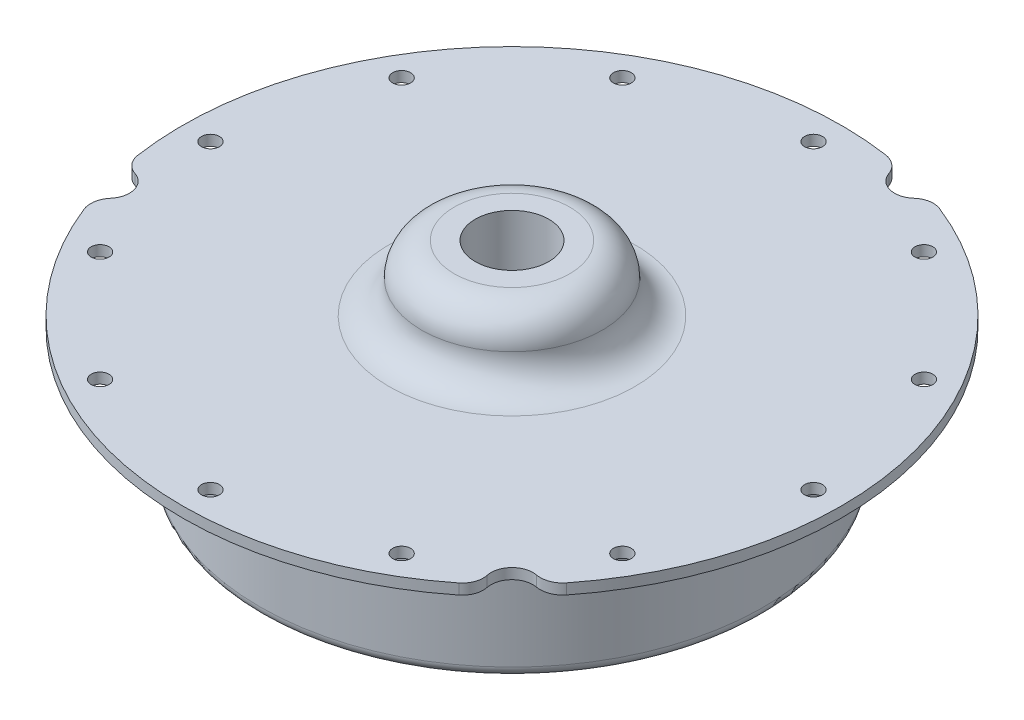
ISO-10303-21;
HEADER;
FILE_DESCRIPTION(('STEP AP214'),'2;1');
FILE_NAME('part.step','',(''),(''),'','','');
FILE_SCHEMA(('AUTOMOTIVE_DESIGN { 1 0 10303 214 1 1 1 1 }'));
ENDSEC;
DATA;
#1=APPLICATION_CONTEXT('core data for automotive mechanical design processes');
#2=APPLICATION_PROTOCOL_DEFINITION('international standard','automotive_design',2000,#1);
#3=PRODUCT_CONTEXT('',#1,'mechanical');
#4=PRODUCT('Part','Part','',(#3));
#5=PRODUCT_RELATED_PRODUCT_CATEGORY('part','',(#4));
#6=PRODUCT_DEFINITION_FORMATION('','',#4);
#7=PRODUCT_DEFINITION_CONTEXT('part definition',#1,'design');
#8=PRODUCT_DEFINITION('design','',#6,#7);
#9=PRODUCT_DEFINITION_SHAPE('','',#8);
#10=(LENGTH_UNIT() NAMED_UNIT(*) SI_UNIT(.MILLI.,.METRE.));
#11=(NAMED_UNIT(*) PLANE_ANGLE_UNIT() SI_UNIT($,.RADIAN.));
#12=(NAMED_UNIT(*) SI_UNIT($,.STERADIAN.) SOLID_ANGLE_UNIT());
#13=UNCERTAINTY_MEASURE_WITH_UNIT(LENGTH_MEASURE(1.E-05),#10,'distance_accuracy_value','');
#14=(GEOMETRIC_REPRESENTATION_CONTEXT(3) GLOBAL_UNCERTAINTY_ASSIGNED_CONTEXT((#13)) GLOBAL_UNIT_ASSIGNED_CONTEXT((#10,
#11,#12)) REPRESENTATION_CONTEXT('',''));
#15=CARTESIAN_POINT('',(0.,0.,0.));
#16=DIRECTION('',(0.,0.,1.));
#17=DIRECTION('',(1.,0.,0.));
#18=AXIS2_PLACEMENT_3D('',#15,#16,#17);
#19=CARTESIAN_POINT('',(0.,55.,0.));
#20=DIRECTION('',(0.,1.,0.));
#21=DIRECTION('',(0.,0.,1.));
#22=AXIS2_PLACEMENT_3D('',#19,#20,#21);
#23=CYLINDRICAL_SURFACE('',#22,49.784);
#24=CARTESIAN_POINT('',(0.,0.,0.));
#25=DIRECTION('',(0.,1.,0.));
#26=DIRECTION('',(0.,0.,1.));
#27=AXIS2_PLACEMENT_3D('',#24,#25,#26);
#28=CIRCLE('',#27,49.784);
#29=CARTESIAN_POINT('',(-46.24721953603,0.,18.4293608458418));
#30=VERTEX_POINT('',#29);
#31=CARTESIAN_POINT('',(30.9609288495699,0.,38.9854785884677));
#32=VERTEX_POINT('',#31);
#33=EDGE_CURVE('E11',#30,#32,#28,.T.);
#34=ORIENTED_EDGE('',*,*,#33,.T.);
#35=DIRECTION('',(0.,1.,0.));
#36=VECTOR('',#35,1.);
#37=CARTESIAN_POINT('',(30.9609288495699,-11.9404867485435,38.9854785884677));
#38=LINE('',#37,#36);
#39=CARTESIAN_POINT('',(30.9609288495699,1.5875,38.9854785884677));
#40=VERTEX_POINT('',#39);
#41=EDGE_CURVE('E123',#32,#40,#38,.T.);
#42=ORIENTED_EDGE('',*,*,#41,.T.);
#43=CARTESIAN_POINT('',(0.,1.5875,0.));
#44=DIRECTION('',(0.,1.,0.));
#45=DIRECTION('',(0.,0.,1.));
#46=AXIS2_PLACEMENT_3D('',#43,#44,#45);
#47=CIRCLE('',#46,49.784);
#48=CARTESIAN_POINT('',(-46.24721953603,1.5875,18.4293608458418));
#49=VERTEX_POINT('',#48);
#50=EDGE_CURVE('E145',#49,#40,#47,.T.);
#51=ORIENTED_EDGE('',*,*,#50,.F.);
#52=DIRECTION('',(0.,1.,0.));
#53=VECTOR('',#52,1.);
#54=CARTESIAN_POINT('',(-46.24721953603,-11.9404867485435,18.4293608458418));
#55=LINE('',#54,#53);
#56=EDGE_CURVE('E144',#30,#49,#55,.T.);
#57=ORIENTED_EDGE('',*,*,#56,.F.);
#58=EDGE_LOOP('',(#34,#42,#51,#57));
#59=FACE_BOUND('',#58,.T.);
#60=ADVANCED_FACE('F32',(#59),#23,.T.);
#61=DIRECTION('',(0.,1.,0.));
#62=VECTOR('',#61,1.);
#63=CARTESIAN_POINT('',(39.083904436024,-11.9404867485435,30.8365865496774));
#64=LINE('',#63,#62);
#65=CARTESIAN_POINT('',(39.083904436024,0.,30.8365865496774));
#66=VERTEX_POINT('',#65);
#67=CARTESIAN_POINT('',(39.083904436024,1.5875,30.8365865496774));
#68=VERTEX_POINT('',#67);
#69=EDGE_CURVE('E284',#66,#68,#64,.T.);
#70=ORIENTED_EDGE('',*,*,#69,.F.);
#71=CARTESIAN_POINT('',(18.2819504115221,0.,-46.305690202724));
#72=VERTEX_POINT('',#71);
#73=EDGE_CURVE('E40',#66,#72,#28,.T.);
#74=ORIENTED_EDGE('',*,*,#73,.T.);
#75=DIRECTION('',(0.,1.,0.));
#76=VECTOR('',#75,1.);
#77=CARTESIAN_POINT('',(18.2819504115221,-11.9404867485435,-46.305690202724));
#78=LINE('',#77,#76);
#79=CARTESIAN_POINT('',(18.2819504115221,1.5875,-46.305690202724));
#80=VERTEX_POINT('',#79);
#81=EDGE_CURVE('E282',#72,#80,#78,.T.);
#82=ORIENTED_EDGE('',*,*,#81,.T.);
#83=EDGE_CURVE('E240',#68,#80,#47,.T.);
#84=ORIENTED_EDGE('',*,*,#83,.F.);
#85=EDGE_LOOP('',(#70,#74,#82,#84));
#86=FACE_BOUND('',#85,.T.);
#87=ADVANCED_FACE('F280',(#86),#23,.T.);
#88=CARTESIAN_POINT('',(-49.784,0.,0.));
#89=DIRECTION('',(0.,-1.,0.));
#90=DIRECTION('',(0.,0.,-1.));
#91=AXIS2_PLACEMENT_3D('',#88,#89,#90);
#92=PLANE('',#91);
#93=CARTESIAN_POINT('',(-39.45170066686,0.,-22.7774499999995));
#94=DIRECTION('',(0.,-1.,0.));
#95=DIRECTION('',(0.,0.,-1.));
#96=AXIS2_PLACEMENT_3D('',#93,#94,#95);
#97=CIRCLE('',#96,1.35254999999999);
#98=CARTESIAN_POINT('',(-39.45170066686,0.,-24.1299999999995));
#99=VERTEX_POINT('',#98);
#100=EDGE_CURVE('E167',#99,#99,#97,.T.);
#101=ORIENTED_EDGE('',*,*,#100,.F.);
#102=EDGE_LOOP('',(#101));
#103=FACE_BOUND('',#102,.T.);
#104=CARTESIAN_POINT('',(-22.7774500000005,0.,-39.4517006668595));
#105=DIRECTION('',(0.,-1.,0.));
#106=DIRECTION('',(0.,0.,-1.));
#107=AXIS2_PLACEMENT_3D('',#104,#105,#106);
#108=CIRCLE('',#107,1.35254999999999);
#109=CARTESIAN_POINT('',(-22.7774500000005,0.,-40.8042506668595));
#110=VERTEX_POINT('',#109);
#111=EDGE_CURVE('E174',#110,#110,#108,.T.);
#112=ORIENTED_EDGE('',*,*,#111,.F.);
#113=EDGE_LOOP('',(#112));
#114=FACE_BOUND('',#113,.T.);
#115=CARTESIAN_POINT('',(-4.88322161388666E-13,0.,-45.5549));
#116=DIRECTION('',(0.,-1.,0.));
#117=DIRECTION('',(0.,0.,-1.));
#118=AXIS2_PLACEMENT_3D('',#115,#116,#117);
#119=CIRCLE('',#118,1.35254999999999);
#120=CARTESIAN_POINT('',(-4.88322161388666E-13,0.,-46.90745));
#121=VERTEX_POINT('',#120);
#122=EDGE_CURVE('E180',#121,#121,#119,.T.);
#123=ORIENTED_EDGE('',*,*,#122,.F.);
#124=EDGE_LOOP('',(#123));
#125=FACE_BOUND('',#124,.T.);
#126=CARTESIAN_POINT('',(22.7774499999996,0.,-39.4517006668599));
#127=DIRECTION('',(0.,-1.,0.));
#128=DIRECTION('',(0.,0.,-1.));
#129=AXIS2_PLACEMENT_3D('',#126,#127,#128);
#130=CIRCLE('',#129,1.35254999999999);
#131=CARTESIAN_POINT('',(22.7774499999996,0.,-40.8042506668599));
#132=VERTEX_POINT('',#131);
#133=EDGE_CURVE('E186',#132,#132,#130,.T.);
#134=ORIENTED_EDGE('',*,*,#133,.F.);
#135=EDGE_LOOP('',(#134));
#136=FACE_BOUND('',#135,.T.);
#137=CARTESIAN_POINT('',(39.4517006668595,0.,-22.7774500000003));
#138=DIRECTION('',(0.,-1.,0.));
#139=DIRECTION('',(0.,0.,-1.));
#140=AXIS2_PLACEMENT_3D('',#137,#138,#139);
#141=CIRCLE('',#140,1.35254999999999);
#142=CARTESIAN_POINT('',(39.4517006668595,0.,-24.1300000000003));
#143=VERTEX_POINT('',#142);
#144=EDGE_CURVE('E192',#143,#143,#141,.T.);
#145=ORIENTED_EDGE('',*,*,#144,.F.);
#146=EDGE_LOOP('',(#145));
#147=FACE_BOUND('',#146,.T.);
#148=CARTESIAN_POINT('',(45.5549,0.,0.));
#149=DIRECTION('',(0.,-1.,0.));
#150=DIRECTION('',(0.,0.,-1.));
#151=AXIS2_PLACEMENT_3D('',#148,#149,#150);
#152=CIRCLE('',#151,1.35254999999999);
#153=CARTESIAN_POINT('',(45.5549,0.,-1.35255));
#154=VERTEX_POINT('',#153);
#155=EDGE_CURVE('E198',#154,#154,#152,.T.);
#156=ORIENTED_EDGE('',*,*,#155,.F.);
#157=EDGE_LOOP('',(#156));
#158=FACE_BOUND('',#157,.T.);
#159=CARTESIAN_POINT('',(39.4517006668598,0.,22.7774499999998));
#160=DIRECTION('',(0.,-1.,0.));
#161=DIRECTION('',(0.,0.,-1.));
#162=AXIS2_PLACEMENT_3D('',#159,#160,#161);
#163=CIRCLE('',#162,1.35254999999999);
#164=CARTESIAN_POINT('',(39.4517006668598,0.,21.4248999999998));
#165=VERTEX_POINT('',#164);
#166=EDGE_CURVE('E204',#165,#165,#163,.T.);
#167=ORIENTED_EDGE('',*,*,#166,.F.);
#168=EDGE_LOOP('',(#167));
#169=FACE_BOUND('',#168,.T.);
#170=CARTESIAN_POINT('',(22.7774500000002,0.,39.4517006668596));
#171=DIRECTION('',(0.,-1.,0.));
#172=DIRECTION('',(0.,0.,-1.));
#173=AXIS2_PLACEMENT_3D('',#170,#171,#172);
#174=CIRCLE('',#173,1.35254999999999);
#175=CARTESIAN_POINT('',(22.7774500000002,0.,38.0991506668596));
#176=VERTEX_POINT('',#175);
#177=EDGE_CURVE('E210',#176,#176,#174,.T.);
#178=ORIENTED_EDGE('',*,*,#177,.F.);
#179=EDGE_LOOP('',(#178));
#180=FACE_BOUND('',#179,.T.);
#181=CARTESIAN_POINT('',(1.59128541652108E-13,0.,45.5549));
#182=DIRECTION('',(0.,-1.,0.));
#183=DIRECTION('',(0.,0.,-1.));
#184=AXIS2_PLACEMENT_3D('',#181,#182,#183);
#185=CIRCLE('',#184,1.35254999999999);
#186=CARTESIAN_POINT('',(1.59128541652108E-13,0.,44.20235));
#187=VERTEX_POINT('',#186);
#188=EDGE_CURVE('E216',#187,#187,#185,.T.);
#189=ORIENTED_EDGE('',*,*,#188,.F.);
#190=EDGE_LOOP('',(#189));
#191=FACE_BOUND('',#190,.T.);
#192=CARTESIAN_POINT('',(-22.7774499999999,0.,39.4517006668598));
#193=DIRECTION('',(0.,-1.,0.));
#194=DIRECTION('',(0.,0.,-1.));
#195=AXIS2_PLACEMENT_3D('',#192,#193,#194);
#196=CIRCLE('',#195,1.35254999999999);
#197=CARTESIAN_POINT('',(-22.7774499999999,0.,38.0991506668598));
#198=VERTEX_POINT('',#197);
#199=EDGE_CURVE('E222',#198,#198,#196,.T.);
#200=ORIENTED_EDGE('',*,*,#199,.F.);
#201=EDGE_LOOP('',(#200));
#202=FACE_BOUND('',#201,.T.);
#203=CARTESIAN_POINT('',(-39.4517006668597,0.,22.7774500000001));
#204=DIRECTION('',(0.,-1.,0.));
#205=DIRECTION('',(0.,0.,-1.));
#206=AXIS2_PLACEMENT_3D('',#203,#204,#205);
#207=CIRCLE('',#206,1.35254999999999);
#208=CARTESIAN_POINT('',(-39.4517006668597,0.,21.4249000000001));
#209=VERTEX_POINT('',#208);
#210=EDGE_CURVE('E228',#209,#209,#207,.T.);
#211=ORIENTED_EDGE('',*,*,#210,.F.);
#212=EDGE_LOOP('',(#211));
#213=FACE_BOUND('',#212,.T.);
#214=CARTESIAN_POINT('',(-45.5549,0.,0.));
#215=DIRECTION('',(0.,-1.,0.));
#216=DIRECTION('',(0.,0.,-1.));
#217=AXIS2_PLACEMENT_3D('',#214,#215,#216);
#218=CIRCLE('',#217,1.35254999999999);
#219=CARTESIAN_POINT('',(-45.5549,0.,-1.35254999999998));
#220=VERTEX_POINT('',#219);
#221=EDGE_CURVE('E234',#220,#220,#218,.T.);
#222=ORIENTED_EDGE('',*,*,#221,.F.);
#223=EDGE_LOOP('',(#222));
#224=FACE_BOUND('',#223,.T.);
#225=CARTESIAN_POINT('',(0.,0.,0.));
#226=DIRECTION('',(0.,1.,0.));
#227=DIRECTION('',(0.,0.,1.));
#228=AXIS2_PLACEMENT_3D('',#225,#226,#227);
#229=CIRCLE('',#228,39.6874999999754);
#230=CARTESIAN_POINT('',(0.,0.,39.6874999999754));
#231=VERTEX_POINT('',#230);
#232=EDGE_CURVE('E269',#231,#231,#229,.T.);
#233=ORIENTED_EDGE('',*,*,#232,.T.);
#234=EDGE_LOOP('',(#233));
#235=FACE_BOUND('',#234,.T.);
#236=ORIENTED_EDGE('',*,*,#73,.F.);
#237=CARTESIAN_POINT('',(36.4006860905184,0.,28.7195694313314));
#238=DIRECTION('',(0.,-1.,0.));
#239=DIRECTION('',(0.,0.,-1.));
#240=AXIS2_PLACEMENT_3D('',#237,#238,#239);
#241=CIRCLE('',#240,3.41780955716199);
#242=CARTESIAN_POINT('',(35.7795826895749,0.,32.0804700151577));
#243=VERTEX_POINT('',#242);
#244=EDGE_CURVE('E286',#243,#66,#241,.F.);
#245=ORIENTED_EDGE('',*,*,#244,.F.);
#246=CARTESIAN_POINT('',(35.2026039945908,0.,35.2026039945914));
#247=DIRECTION('',(0.,-1.,0.));
#248=DIRECTION('',(0.,0.,-1.));
#249=AXIS2_PLACEMENT_3D('',#246,#247,#248);
#250=CIRCLE('',#249,3.17500000000001);
#251=CARTESIAN_POINT('',(32.0944919051936,0.,35.8508818977646));
#252=VERTEX_POINT('',#251);
#253=EDGE_CURVE('E140',#252,#243,#250,.T.);
#254=ORIENTED_EDGE('',*,*,#253,.F.);
#255=CARTESIAN_POINT('',(28.9863798157963,0.,36.4991598009378));
#256=DIRECTION('',(0.,-1.,0.));
#257=DIRECTION('',(0.,0.,-1.));
#258=AXIS2_PLACEMENT_3D('',#255,#256,#257);
#259=CIRCLE('',#258,3.175);
#260=EDGE_CURVE('E126',#32,#252,#259,.F.);
#261=ORIENTED_EDGE('',*,*,#260,.F.);
#262=ORIENTED_EDGE('',*,*,#33,.F.);
#263=CARTESIAN_POINT('',(-43.072219758543,0.,17.1641341539066));
#264=DIRECTION('',(0.,-1.,0.));
#265=DIRECTION('',(0.,0.,-1.));
#266=AXIS2_PLACEMENT_3D('',#263,#264,#265);
#267=CIRCLE('',#266,3.417809557162);
#268=CARTESIAN_POINT('',(-45.6722933432588,0.,14.9457925383994));
#269=VERTEX_POINT('',#268);
#270=EDGE_CURVE('E317',#269,#30,#267,.F.);
#271=ORIENTED_EDGE('',*,*,#270,.F.);
#272=CARTESIAN_POINT('',(-48.087651335975,0.,12.885047341384));
#273=DIRECTION('',(0.,-1.,0.));
#274=DIRECTION('',(0.,0.,-1.));
#275=AXIS2_PLACEMENT_3D('',#272,#273,#274);
#276=CIRCLE('',#275,3.175);
#277=CARTESIAN_POINT('',(-47.0950204241365,0.,9.8692043625698));
#278=VERTEX_POINT('',#277);
#279=EDGE_CURVE('E156',#278,#269,#276,.T.);
#280=ORIENTED_EDGE('',*,*,#279,.F.);
#281=CARTESIAN_POINT('',(-46.102389512298,0.,6.85336138375563));
#282=DIRECTION('',(0.,-1.,0.));
#283=DIRECTION('',(0.,0.,-1.));
#284=AXIS2_PLACEMENT_3D('',#281,#282,#283);
#285=CIRCLE('',#284,3.175);
#286=CARTESIAN_POINT('',(-49.2428792610922,0.,7.32021161425669));
#287=VERTEX_POINT('',#286);
#288=EDGE_CURVE('E168',#287,#278,#285,.F.);
#289=ORIENTED_EDGE('',*,*,#288,.F.);
#290=CARTESIAN_POINT('',(7.16331569483476,0.,-49.2659473090301));
#291=VERTEX_POINT('',#290);
#292=EDGE_CURVE('E41',#291,#287,#28,.T.);
#293=ORIENTED_EDGE('',*,*,#292,.F.);
#294=CARTESIAN_POINT('',(6.67153366802452,0.,-45.8837035852375));
#295=DIRECTION('',(0.,-1.,0.));
#296=DIRECTION('',(0.,0.,-1.));
#297=AXIS2_PLACEMENT_3D('',#294,#295,#296);
#298=CIRCLE('',#297,3.417809557162);
#299=CARTESIAN_POINT('',(9.8927106536838,0.,-47.0262625535567));
#300=VERTEX_POINT('',#299);
#301=EDGE_CURVE('E297',#300,#291,#298,.F.);
#302=ORIENTED_EDGE('',*,*,#301,.F.);
#303=CARTESIAN_POINT('',(12.885047341384,0.,-48.087651335975));
#304=DIRECTION('',(0.,-1.,0.));
#305=DIRECTION('',(0.,0.,-1.));
#306=AXIS2_PLACEMENT_3D('',#303,#304,#305);
#307=CIRCLE('',#306,3.17500000000001);
#308=CARTESIAN_POINT('',(15.0005285189428,0.,-45.720086260334));
#309=VERTEX_POINT('',#308);
#310=EDGE_CURVE('E292',#309,#300,#307,.T.);
#311=ORIENTED_EDGE('',*,*,#310,.F.);
#312=CARTESIAN_POINT('',(17.1160096965016,0.,-43.3525211846931));
#313=DIRECTION('',(0.,-1.,0.));
#314=DIRECTION('',(0.,0.,-1.));
#315=AXIS2_PLACEMENT_3D('',#312,#313,#314);
#316=CIRCLE('',#315,3.175);
#317=EDGE_CURVE('E289',#72,#309,#316,.F.);
#318=ORIENTED_EDGE('',*,*,#317,.F.);
#319=EDGE_LOOP('',(#236,#245,#254,#261,#262,#271,#280,#289,#293,#302,#311,#318));
#320=FACE_BOUND('',#319,.T.);
#321=ADVANCED_FACE('F137',(#103,#114,#125,#136,#147,#158,#169,#180,#191,#202,#213,#224,#235,
#320),#92,.T.);
#322=CARTESIAN_POINT('',(-49.784,1.5875,0.));
#323=DIRECTION('',(0.,1.,0.));
#324=DIRECTION('',(0.,0.,1.));
#325=AXIS2_PLACEMENT_3D('',#322,#323,#324);
#326=PLANE('',#325);
#327=CARTESIAN_POINT('',(-39.45170066686,1.58750000000002,-22.7774499999995));
#328=DIRECTION('',(0.,1.,0.));
#329=DIRECTION('',(0.,0.,1.));
#330=AXIS2_PLACEMENT_3D('',#327,#328,#329);
#331=CIRCLE('',#330,1.35254999999999);
#332=CARTESIAN_POINT('',(-39.45170066686,1.58750000000002,-21.4248999999995));
#333=VERTEX_POINT('',#332);
#334=EDGE_CURVE('E164',#333,#333,#331,.T.);
#335=ORIENTED_EDGE('',*,*,#334,.F.);
#336=EDGE_LOOP('',(#335));
#337=FACE_BOUND('',#336,.T.);
#338=CARTESIAN_POINT('',(-22.7774500000005,1.58750000000008,-39.4517006668595));
#339=DIRECTION('',(0.,1.,0.));
#340=DIRECTION('',(0.,0.,1.));
#341=AXIS2_PLACEMENT_3D('',#338,#339,#340);
#342=CIRCLE('',#341,1.35254999999999);
#343=CARTESIAN_POINT('',(-22.7774500000005,1.58750000000008,-38.0991506668595));
#344=VERTEX_POINT('',#343);
#345=EDGE_CURVE('E171',#344,#344,#342,.T.);
#346=ORIENTED_EDGE('',*,*,#345,.F.);
#347=EDGE_LOOP('',(#346));
#348=FACE_BOUND('',#347,.T.);
#349=CARTESIAN_POINT('',(-4.88322161388666E-13,1.58750000000016,-45.5549));
#350=DIRECTION('',(0.,1.,0.));
#351=DIRECTION('',(0.,0.,1.));
#352=AXIS2_PLACEMENT_3D('',#349,#350,#351);
#353=CIRCLE('',#352,1.35254999999999);
#354=CARTESIAN_POINT('',(-4.88322161388666E-13,1.58750000000016,-44.20235));
#355=VERTEX_POINT('',#354);
#356=EDGE_CURVE('E177',#355,#355,#353,.T.);
#357=ORIENTED_EDGE('',*,*,#356,.F.);
#358=EDGE_LOOP('',(#357));
#359=FACE_BOUND('',#358,.T.);
#360=CARTESIAN_POINT('',(22.7774499999996,1.58750000000024,-39.4517006668599));
#361=DIRECTION('',(0.,1.,0.));
#362=DIRECTION('',(0.,0.,1.));
#363=AXIS2_PLACEMENT_3D('',#360,#361,#362);
#364=CIRCLE('',#363,1.35254999999999);
#365=CARTESIAN_POINT('',(22.7774499999996,1.58750000000024,-38.0991506668599));
#366=VERTEX_POINT('',#365);
#367=EDGE_CURVE('E183',#366,#366,#364,.T.);
#368=ORIENTED_EDGE('',*,*,#367,.F.);
#369=EDGE_LOOP('',(#368));
#370=FACE_BOUND('',#369,.T.);
#371=CARTESIAN_POINT('',(39.4517006668595,1.5875000000003,-22.7774500000003));
#372=DIRECTION('',(0.,1.,0.));
#373=DIRECTION('',(0.,0.,1.));
#374=AXIS2_PLACEMENT_3D('',#371,#372,#373);
#375=CIRCLE('',#374,1.35254999999999);
#376=CARTESIAN_POINT('',(39.4517006668595,1.5875000000003,-21.4249000000003));
#377=VERTEX_POINT('',#376);
#378=EDGE_CURVE('E189',#377,#377,#375,.T.);
#379=ORIENTED_EDGE('',*,*,#378,.F.);
#380=EDGE_LOOP('',(#379));
#381=FACE_BOUND('',#380,.T.);
#382=CARTESIAN_POINT('',(45.5549,1.58750000000032,0.));
#383=DIRECTION('',(0.,1.,0.));
#384=DIRECTION('',(0.,0.,1.));
#385=AXIS2_PLACEMENT_3D('',#382,#383,#384);
#386=CIRCLE('',#385,1.35254999999999);
#387=CARTESIAN_POINT('',(45.5549,1.58750000000032,1.35254999999998));
#388=VERTEX_POINT('',#387);
#389=EDGE_CURVE('E195',#388,#388,#386,.T.);
#390=ORIENTED_EDGE('',*,*,#389,.F.);
#391=EDGE_LOOP('',(#390));
#392=FACE_BOUND('',#391,.T.);
#393=CARTESIAN_POINT('',(39.4517006668598,1.5875000000003,22.7774499999998));
#394=DIRECTION('',(0.,1.,0.));
#395=DIRECTION('',(0.,0.,1.));
#396=AXIS2_PLACEMENT_3D('',#393,#394,#395);
#397=CIRCLE('',#396,1.35254999999999);
#398=CARTESIAN_POINT('',(39.4517006668598,1.5875000000003,24.1299999999998));
#399=VERTEX_POINT('',#398);
#400=EDGE_CURVE('E201',#399,#399,#397,.T.);
#401=ORIENTED_EDGE('',*,*,#400,.F.);
#402=EDGE_LOOP('',(#401));
#403=FACE_BOUND('',#402,.T.);
#404=CARTESIAN_POINT('',(22.7774500000002,1.58750000000024,39.4517006668596));
#405=DIRECTION('',(0.,1.,0.));
#406=DIRECTION('',(0.,0.,1.));
#407=AXIS2_PLACEMENT_3D('',#404,#405,#406);
#408=CIRCLE('',#407,1.35254999999999);
#409=CARTESIAN_POINT('',(22.7774500000002,1.58750000000024,40.8042506668596));
#410=VERTEX_POINT('',#409);
#411=EDGE_CURVE('E207',#410,#410,#408,.T.);
#412=ORIENTED_EDGE('',*,*,#411,.F.);
#413=EDGE_LOOP('',(#412));
#414=FACE_BOUND('',#413,.T.);
#415=CARTESIAN_POINT('',(1.59128541652108E-13,1.58750000000016,45.5549));
#416=DIRECTION('',(0.,1.,0.));
#417=DIRECTION('',(0.,0.,1.));
#418=AXIS2_PLACEMENT_3D('',#415,#416,#417);
#419=CIRCLE('',#418,1.35254999999999);
#420=CARTESIAN_POINT('',(1.59128541652108E-13,1.58750000000017,46.90745));
#421=VERTEX_POINT('',#420);
#422=EDGE_CURVE('E213',#421,#421,#419,.T.);
#423=ORIENTED_EDGE('',*,*,#422,.F.);
#424=EDGE_LOOP('',(#423));
#425=FACE_BOUND('',#424,.T.);
#426=CARTESIAN_POINT('',(-22.7774499999999,1.58750000000008,39.4517006668598));
#427=DIRECTION('',(0.,1.,0.));
#428=DIRECTION('',(0.,0.,1.));
#429=AXIS2_PLACEMENT_3D('',#426,#427,#428);
#430=CIRCLE('',#429,1.35254999999999);
#431=CARTESIAN_POINT('',(-22.7774499999999,1.58750000000009,40.8042506668598));
#432=VERTEX_POINT('',#431);
#433=EDGE_CURVE('E219',#432,#432,#430,.T.);
#434=ORIENTED_EDGE('',*,*,#433,.F.);
#435=EDGE_LOOP('',(#434));
#436=FACE_BOUND('',#435,.T.);
#437=CARTESIAN_POINT('',(-39.4517006668597,1.58750000000002,22.77745));
#438=DIRECTION('',(0.,1.,0.));
#439=DIRECTION('',(0.,0.,1.));
#440=AXIS2_PLACEMENT_3D('',#437,#438,#439);
#441=CIRCLE('',#440,1.35254999999999);
#442=CARTESIAN_POINT('',(-39.4517006668597,1.58750000000003,24.13));
#443=VERTEX_POINT('',#442);
#444=EDGE_CURVE('E225',#443,#443,#441,.T.);
#445=ORIENTED_EDGE('',*,*,#444,.F.);
#446=EDGE_LOOP('',(#445));
#447=FACE_BOUND('',#446,.T.);
#448=CARTESIAN_POINT('',(-45.5549,1.5875,0.));
#449=DIRECTION('',(0.,1.,0.));
#450=DIRECTION('',(0.,0.,1.));
#451=AXIS2_PLACEMENT_3D('',#448,#449,#450);
#452=CIRCLE('',#451,1.35254999999999);
#453=CARTESIAN_POINT('',(-45.5549,1.5875,1.35254999999999));
#454=VERTEX_POINT('',#453);
#455=EDGE_CURVE('E231',#454,#454,#452,.T.);
#456=ORIENTED_EDGE('',*,*,#455,.F.);
#457=EDGE_LOOP('',(#456));
#458=FACE_BOUND('',#457,.T.);
#459=CARTESIAN_POINT('',(0.,1.5875,0.));
#460=DIRECTION('',(0.,1.,0.));
#461=DIRECTION('',(0.,0.,1.));
#462=AXIS2_PLACEMENT_3D('',#459,#460,#461);
#463=CIRCLE('',#462,18.57375);
#464=CARTESIAN_POINT('',(0.,1.5875,18.57375));
#465=VERTEX_POINT('',#464);
#466=EDGE_CURVE('E239',#465,#465,#463,.T.);
#467=ORIENTED_EDGE('',*,*,#466,.F.);
#468=EDGE_LOOP('',(#467));
#469=FACE_BOUND('',#468,.T.);
#470=CARTESIAN_POINT('',(35.2026039945908,1.5875,35.2026039945914));
#471=DIRECTION('',(0.,1.,0.));
#472=DIRECTION('',(0.,0.,1.));
#473=AXIS2_PLACEMENT_3D('',#470,#471,#472);
#474=CIRCLE('',#473,3.17500000000001);
#475=CARTESIAN_POINT('',(32.0944919051936,1.5875,35.8508818977646));
#476=VERTEX_POINT('',#475);
#477=CARTESIAN_POINT('',(35.7795826895749,1.5875,32.0804700151577));
#478=VERTEX_POINT('',#477);
#479=EDGE_CURVE('E48',#476,#478,#474,.F.);
#480=ORIENTED_EDGE('',*,*,#479,.T.);
#481=CARTESIAN_POINT('',(36.4006860905184,1.5875,28.7195694313314));
#482=DIRECTION('',(0.,1.,0.));
#483=DIRECTION('',(0.,0.,1.));
#484=AXIS2_PLACEMENT_3D('',#481,#482,#483);
#485=CIRCLE('',#484,3.41780955716199);
#486=EDGE_CURVE('E332',#478,#68,#485,.T.);
#487=ORIENTED_EDGE('',*,*,#486,.T.);
#488=ORIENTED_EDGE('',*,*,#83,.T.);
#489=CARTESIAN_POINT('',(17.1160096965016,1.5875,-43.3525211846931));
#490=DIRECTION('',(0.,1.,0.));
#491=DIRECTION('',(0.,0.,1.));
#492=AXIS2_PLACEMENT_3D('',#489,#490,#491);
#493=CIRCLE('',#492,3.175);
#494=CARTESIAN_POINT('',(15.0005285189428,1.5875,-45.720086260334));
#495=VERTEX_POINT('',#494);
#496=EDGE_CURVE('E304',#80,#495,#493,.T.);
#497=ORIENTED_EDGE('',*,*,#496,.T.);
#498=CARTESIAN_POINT('',(12.885047341384,1.5875,-48.087651335975));
#499=DIRECTION('',(0.,-1.,0.));
#500=DIRECTION('',(0.,0.,-1.));
#501=AXIS2_PLACEMENT_3D('',#498,#499,#500);
#502=CIRCLE('',#501,3.17500000000001);
#503=CARTESIAN_POINT('',(9.8927106536838,1.5875,-47.0262625535567));
#504=VERTEX_POINT('',#503);
#505=EDGE_CURVE('E307',#495,#504,#502,.T.);
#506=ORIENTED_EDGE('',*,*,#505,.T.);
#507=CARTESIAN_POINT('',(6.67153366802452,1.5875,-45.8837035852375));
#508=DIRECTION('',(0.,1.,0.));
#509=DIRECTION('',(0.,0.,1.));
#510=AXIS2_PLACEMENT_3D('',#507,#508,#509);
#511=CIRCLE('',#510,3.417809557162);
#512=CARTESIAN_POINT('',(7.16331569483476,1.5875,-49.2659473090301));
#513=VERTEX_POINT('',#512);
#514=EDGE_CURVE('E295',#504,#513,#511,.T.);
#515=ORIENTED_EDGE('',*,*,#514,.T.);
#516=CARTESIAN_POINT('',(-49.2428792610922,1.5875,7.32021161425669));
#517=VERTEX_POINT('',#516);
#518=EDGE_CURVE('E237',#513,#517,#47,.T.);
#519=ORIENTED_EDGE('',*,*,#518,.T.);
#520=CARTESIAN_POINT('',(-46.102389512298,1.5875,6.85336138375563));
#521=DIRECTION('',(0.,1.,0.));
#522=DIRECTION('',(0.,0.,1.));
#523=AXIS2_PLACEMENT_3D('',#520,#521,#522);
#524=CIRCLE('',#523,3.175);
#525=CARTESIAN_POINT('',(-47.0950204241365,1.5875,9.8692043625698));
#526=VERTEX_POINT('',#525);
#527=EDGE_CURVE('E152',#517,#526,#524,.T.);
#528=ORIENTED_EDGE('',*,*,#527,.T.);
#529=CARTESIAN_POINT('',(-48.087651335975,1.5875,12.885047341384));
#530=DIRECTION('',(0.,1.,0.));
#531=DIRECTION('',(0.,0.,1.));
#532=AXIS2_PLACEMENT_3D('',#529,#530,#531);
#533=CIRCLE('',#532,3.175);
#534=CARTESIAN_POINT('',(-45.6722933432588,1.5875,14.9457925383994));
#535=VERTEX_POINT('',#534);
#536=EDGE_CURVE('E161',#526,#535,#533,.F.);
#537=ORIENTED_EDGE('',*,*,#536,.T.);
#538=CARTESIAN_POINT('',(-43.072219758543,1.5875,17.1641341539066));
#539=DIRECTION('',(0.,1.,0.));
#540=DIRECTION('',(0.,0.,1.));
#541=AXIS2_PLACEMENT_3D('',#538,#539,#540);
#542=CIRCLE('',#541,3.417809557162);
#543=EDGE_CURVE('E149',#535,#49,#542,.T.);
#544=ORIENTED_EDGE('',*,*,#543,.T.);
#545=ORIENTED_EDGE('',*,*,#50,.T.);
#546=CARTESIAN_POINT('',(28.9863798157963,1.5875,36.4991598009378));
#547=DIRECTION('',(0.,1.,0.));
#548=DIRECTION('',(0.,0.,1.));
#549=AXIS2_PLACEMENT_3D('',#546,#547,#548);
#550=CIRCLE('',#549,3.175);
#551=EDGE_CURVE('E128',#40,#476,#550,.T.);
#552=ORIENTED_EDGE('',*,*,#551,.T.);
#553=EDGE_LOOP('',(#480,#487,#488,#497,#506,#515,#519,#528,#537,#544,#545,#552));
#554=FACE_BOUND('',#553,.T.);
#555=ADVANCED_FACE('F330',(#337,#348,#359,#370,#381,#392,#403,#414,#425,#436,#447,#458,#469,
#554),#326,.T.);
#556=DIRECTION('',(0.,1.,0.));
#557=VECTOR('',#556,1.);
#558=CARTESIAN_POINT('',(7.16331569483476,-11.9404867485435,-49.2659473090301));
#559=LINE('',#558,#557);
#560=EDGE_CURVE('E56',#291,#513,#559,.T.);
#561=ORIENTED_EDGE('',*,*,#560,.F.);
#562=ORIENTED_EDGE('',*,*,#292,.T.);
#563=DIRECTION('',(0.,1.,0.));
#564=VECTOR('',#563,1.);
#565=CARTESIAN_POINT('',(-49.2428792610922,-11.9404867485435,7.32021161425669));
#566=LINE('',#565,#564);
#567=EDGE_CURVE('E148',#287,#517,#566,.T.);
#568=ORIENTED_EDGE('',*,*,#567,.T.);
#569=ORIENTED_EDGE('',*,*,#518,.F.);
#570=EDGE_LOOP('',(#561,#562,#568,#569));
#571=FACE_BOUND('',#570,.T.);
#572=ADVANCED_FACE('F34',(#571),#23,.T.);
#573=CARTESIAN_POINT('',(0.,-1.5875,0.));
#574=DIRECTION('',(0.,1.,0.));
#575=DIRECTION('',(0.,0.,1.));
#576=AXIS2_PLACEMENT_3D('',#573,#574,#575);
#577=TOROIDAL_SURFACE('',#576,39.6874999999754,1.5875);
#578=CARTESIAN_POINT('',(0.,-1.5875,0.));
#579=DIRECTION('',(0.,1.,0.));
#580=DIRECTION('',(0.,0.,1.));
#581=AXIS2_PLACEMENT_3D('',#578,#579,#580);
#582=CIRCLE('',#581,38.0999999999754);
#583=CARTESIAN_POINT('',(0.,-1.5875,38.0999999999754));
#584=VERTEX_POINT('',#583);
#585=EDGE_CURVE('E267',#584,#584,#582,.T.);
#586=ORIENTED_EDGE('',*,*,#585,.T.);
#587=EDGE_LOOP('',(#586));
#588=FACE_BOUND('',#587,.T.);
#589=ORIENTED_EDGE('',*,*,#232,.F.);
#590=EDGE_LOOP('',(#589));
#591=FACE_BOUND('',#590,.T.);
#592=ADVANCED_FACE('F364',(#588,#591),#577,.F.);
#593=CARTESIAN_POINT('',(0.,55.,0.));
#594=DIRECTION('',(0.,1.,0.));
#595=DIRECTION('',(0.,0.,1.));
#596=AXIS2_PLACEMENT_3D('',#593,#594,#595);
#597=CYLINDRICAL_SURFACE('',#596,38.0999999999754);
#598=CARTESIAN_POINT('',(0.,-17.4625,0.));
#599=DIRECTION('',(0.,1.,0.));
#600=DIRECTION('',(0.,0.,1.));
#601=AXIS2_PLACEMENT_3D('',#598,#599,#600);
#602=CIRCLE('',#601,38.0999999999754);
#603=CARTESIAN_POINT('',(0.,-17.4625,38.0999999999754));
#604=VERTEX_POINT('',#603);
#605=EDGE_CURVE('E264',#604,#604,#602,.T.);
#606=ORIENTED_EDGE('',*,*,#605,.T.);
#607=EDGE_LOOP('',(#606));
#608=FACE_BOUND('',#607,.T.);
#609=ORIENTED_EDGE('',*,*,#585,.F.);
#610=EDGE_LOOP('',(#609));
#611=FACE_BOUND('',#610,.T.);
#612=ADVANCED_FACE('F369',(#608,#611),#597,.T.);
#613=CARTESIAN_POINT('',(0.,-17.4625,0.));
#614=DIRECTION('',(0.,1.,0.));
#615=DIRECTION('',(0.,0.,1.));
#616=AXIS2_PLACEMENT_3D('',#613,#614,#615);
#617=TOROIDAL_SURFACE('',#616,36.5124999999754,1.5875);
#618=CARTESIAN_POINT('',(0.,-17.4625,0.));
#619=DIRECTION('',(0.,1.,0.));
#620=DIRECTION('',(0.,0.,1.));
#621=AXIS2_PLACEMENT_3D('',#618,#619,#620);
#622=CIRCLE('',#621,34.9249999999754);
#623=CARTESIAN_POINT('',(0.,-17.4625,34.9249999999754));
#624=VERTEX_POINT('',#623);
#625=EDGE_CURVE('E261',#624,#624,#622,.T.);
#626=ORIENTED_EDGE('',*,*,#625,.T.);
#627=EDGE_LOOP('',(#626));
#628=FACE_BOUND('',#627,.T.);
#629=ORIENTED_EDGE('',*,*,#605,.F.);
#630=EDGE_LOOP('',(#629));
#631=FACE_BOUND('',#630,.T.);
#632=ADVANCED_FACE('F411',(#628,#631),#617,.T.);
#633=CARTESIAN_POINT('',(0.,55.,0.));
#634=DIRECTION('',(0.,1.,0.));
#635=DIRECTION('',(0.,0.,1.));
#636=AXIS2_PLACEMENT_3D('',#633,#634,#635);
#637=CYLINDRICAL_SURFACE('',#636,34.9249999999754);
#638=CARTESIAN_POINT('',(0.,-3.175,0.));
#639=DIRECTION('',(0.,1.,0.));
#640=DIRECTION('',(0.,0.,1.));
#641=AXIS2_PLACEMENT_3D('',#638,#639,#640);
#642=CIRCLE('',#641,34.9249999999754);
#643=CARTESIAN_POINT('',(0.,-3.175,34.9249999999754));
#644=VERTEX_POINT('',#643);
#645=EDGE_CURVE('E258',#644,#644,#642,.T.);
#646=ORIENTED_EDGE('',*,*,#645,.T.);
#647=EDGE_LOOP('',(#646));
#648=FACE_BOUND('',#647,.T.);
#649=ORIENTED_EDGE('',*,*,#625,.F.);
#650=EDGE_LOOP('',(#649));
#651=FACE_BOUND('',#650,.T.);
#652=ADVANCED_FACE('F407',(#648,#651),#637,.F.);
#653=CARTESIAN_POINT('',(0.,-3.175,0.));
#654=DIRECTION('',(0.,1.,0.));
#655=DIRECTION('',(0.,0.,1.));
#656=AXIS2_PLACEMENT_3D('',#653,#654,#655);
#657=TOROIDAL_SURFACE('',#656,31.7499999999754,3.17499999999999);
#658=CARTESIAN_POINT('',(0.,0.,0.));
#659=DIRECTION('',(0.,1.,0.));
#660=DIRECTION('',(0.,0.,1.));
#661=AXIS2_PLACEMENT_3D('',#658,#659,#660);
#662=CIRCLE('',#661,31.7499999999754);
#663=CARTESIAN_POINT('',(0.,0.,31.7499999999754));
#664=VERTEX_POINT('',#663);
#665=EDGE_CURVE('E255',#664,#664,#662,.T.);
#666=ORIENTED_EDGE('',*,*,#665,.T.);
#667=EDGE_LOOP('',(#666));
#668=FACE_BOUND('',#667,.T.);
#669=ORIENTED_EDGE('',*,*,#645,.F.);
#670=EDGE_LOOP('',(#669));
#671=FACE_BOUND('',#670,.T.);
#672=ADVANCED_FACE('F403',(#668,#671),#657,.F.);
#673=CARTESIAN_POINT('',(-31.7499999999754,0.,0.));
#674=DIRECTION('',(0.,-1.,0.));
#675=DIRECTION('',(0.,0.,-1.));
#676=AXIS2_PLACEMENT_3D('',#673,#674,#675);
#677=PLANE('',#676);
#678=CARTESIAN_POINT('',(0.,0.,0.));
#679=DIRECTION('',(0.,1.,0.));
#680=DIRECTION('',(0.,0.,1.));
#681=AXIS2_PLACEMENT_3D('',#678,#679,#680);
#682=CIRCLE('',#681,5.55625);
#683=CARTESIAN_POINT('',(0.,0.,5.55625));
#684=VERTEX_POINT('',#683);
#685=EDGE_CURVE('E252',#684,#684,#682,.T.);
#686=ORIENTED_EDGE('',*,*,#685,.T.);
#687=EDGE_LOOP('',(#686));
#688=FACE_BOUND('',#687,.T.);
#689=ORIENTED_EDGE('',*,*,#665,.F.);
#690=EDGE_LOOP('',(#689));
#691=FACE_BOUND('',#690,.T.);
#692=ADVANCED_FACE('F399',(#688,#691),#677,.T.);
#693=CARTESIAN_POINT('',(0.,55.,0.));
#694=DIRECTION('',(0.,1.,0.));
#695=DIRECTION('',(0.,0.,1.));
#696=AXIS2_PLACEMENT_3D('',#693,#694,#695);
#697=CYLINDRICAL_SURFACE('',#696,5.55625);
#698=CARTESIAN_POINT('',(0.,11.43,0.));
#699=DIRECTION('',(0.,1.,0.));
#700=DIRECTION('',(0.,0.,1.));
#701=AXIS2_PLACEMENT_3D('',#698,#699,#700);
#702=CIRCLE('',#701,5.55625);
#703=CARTESIAN_POINT('',(0.,11.43,5.55625));
#704=VERTEX_POINT('',#703);
#705=EDGE_CURVE('E249',#704,#704,#702,.T.);
#706=ORIENTED_EDGE('',*,*,#705,.T.);
#707=EDGE_LOOP('',(#706));
#708=FACE_BOUND('',#707,.T.);
#709=ORIENTED_EDGE('',*,*,#685,.F.);
#710=EDGE_LOOP('',(#709));
#711=FACE_BOUND('',#710,.T.);
#712=ADVANCED_FACE('F395',(#708,#711),#697,.F.);
#713=CARTESIAN_POINT('',(-5.55625,11.43,0.));
#714=DIRECTION('',(0.,1.,0.));
#715=DIRECTION('',(0.,0.,1.));
#716=AXIS2_PLACEMENT_3D('',#713,#714,#715);
#717=PLANE('',#716);
#718=CARTESIAN_POINT('',(0.,11.43,0.));
#719=DIRECTION('',(0.,1.,0.));
#720=DIRECTION('',(0.,0.,1.));
#721=AXIS2_PLACEMENT_3D('',#718,#719,#720);
#722=CIRCLE('',#721,8.73125);
#723=CARTESIAN_POINT('',(0.,11.43,8.73125));
#724=VERTEX_POINT('',#723);
#725=EDGE_CURVE('E246',#724,#724,#722,.T.);
#726=ORIENTED_EDGE('',*,*,#725,.T.);
#727=EDGE_LOOP('',(#726));
#728=FACE_BOUND('',#727,.T.);
#729=ORIENTED_EDGE('',*,*,#705,.F.);
#730=EDGE_LOOP('',(#729));
#731=FACE_BOUND('',#730,.T.);
#732=ADVANCED_FACE('F391',(#728,#731),#717,.T.);
#733=CARTESIAN_POINT('',(0.,6.50875,0.));
#734=DIRECTION('',(0.,1.,0.));
#735=DIRECTION('',(0.,0.,1.));
#736=AXIS2_PLACEMENT_3D('',#733,#734,#735);
#737=TOROIDAL_SURFACE('',#736,8.73125,4.92125);
#738=CARTESIAN_POINT('',(0.,6.50875,0.));
#739=DIRECTION('',(0.,1.,0.));
#740=DIRECTION('',(0.,0.,1.));
#741=AXIS2_PLACEMENT_3D('',#738,#739,#740);
#742=CIRCLE('',#741,13.6525);
#743=CARTESIAN_POINT('',(0.,6.50875,13.6525));
#744=VERTEX_POINT('',#743);
#745=EDGE_CURVE('E243',#744,#744,#742,.T.);
#746=ORIENTED_EDGE('',*,*,#745,.T.);
#747=EDGE_LOOP('',(#746));
#748=FACE_BOUND('',#747,.T.);
#749=ORIENTED_EDGE('',*,*,#725,.F.);
#750=EDGE_LOOP('',(#749));
#751=FACE_BOUND('',#750,.T.);
#752=ADVANCED_FACE('F387',(#748,#751),#737,.T.);
#753=CARTESIAN_POINT('',(0.,6.50875,0.));
#754=DIRECTION('',(0.,1.,0.));
#755=DIRECTION('',(0.,0.,1.));
#756=AXIS2_PLACEMENT_3D('',#753,#754,#755);
#757=TOROIDAL_SURFACE('',#756,18.57375,4.92125);
#758=ORIENTED_EDGE('',*,*,#466,.T.);
#759=EDGE_LOOP('',(#758));
#760=FACE_BOUND('',#759,.T.);
#761=ORIENTED_EDGE('',*,*,#745,.F.);
#762=EDGE_LOOP('',(#761));
#763=FACE_BOUND('',#762,.T.);
#764=ADVANCED_FACE('F384',(#760,#763),#757,.F.);
#765=CARTESIAN_POINT('',(-45.5549,1.5875,0.));
#766=DIRECTION('',(0.,1.,0.));
#767=DIRECTION('',(0.,0.,1.));
#768=AXIS2_PLACEMENT_3D('',#765,#766,#767);
#769=CYLINDRICAL_SURFACE('',#768,1.35254999999999);
#770=ORIENTED_EDGE('',*,*,#221,.T.);
#771=EDGE_LOOP('',(#770));
#772=FACE_BOUND('',#771,.T.);
#773=ORIENTED_EDGE('',*,*,#455,.T.);
#774=EDGE_LOOP('',(#773));
#775=FACE_BOUND('',#774,.T.);
#776=ADVANCED_FACE('F382',(#772,#775),#769,.F.);
#777=CARTESIAN_POINT('',(-39.4517006668597,1.58750000000002,22.77745));
#778=DIRECTION('',(0.,1.,0.));
#779=DIRECTION('',(0.,0.,1.));
#780=AXIS2_PLACEMENT_3D('',#777,#778,#779);
#781=CYLINDRICAL_SURFACE('',#780,1.35254999999999);
#782=ORIENTED_EDGE('',*,*,#210,.T.);
#783=EDGE_LOOP('',(#782));
#784=FACE_BOUND('',#783,.T.);
#785=ORIENTED_EDGE('',*,*,#444,.T.);
#786=EDGE_LOOP('',(#785));
#787=FACE_BOUND('',#786,.T.);
#788=ADVANCED_FACE('F465',(#784,#787),#781,.F.);
#789=CARTESIAN_POINT('',(-22.7774499999999,1.58750000000008,39.4517006668598));
#790=DIRECTION('',(0.,1.,0.));
#791=DIRECTION('',(0.,0.,1.));
#792=AXIS2_PLACEMENT_3D('',#789,#790,#791);
#793=CYLINDRICAL_SURFACE('',#792,1.35254999999999);
#794=ORIENTED_EDGE('',*,*,#199,.T.);
#795=EDGE_LOOP('',(#794));
#796=FACE_BOUND('',#795,.T.);
#797=ORIENTED_EDGE('',*,*,#433,.T.);
#798=EDGE_LOOP('',(#797));
#799=FACE_BOUND('',#798,.T.);
#800=ADVANCED_FACE('F472',(#796,#799),#793,.F.);
#801=CARTESIAN_POINT('',(1.59128541652108E-13,1.58750000000016,45.5549));
#802=DIRECTION('',(0.,1.,0.));
#803=DIRECTION('',(0.,0.,1.));
#804=AXIS2_PLACEMENT_3D('',#801,#802,#803);
#805=CYLINDRICAL_SURFACE('',#804,1.35254999999999);
#806=ORIENTED_EDGE('',*,*,#188,.T.);
#807=EDGE_LOOP('',(#806));
#808=FACE_BOUND('',#807,.T.);
#809=ORIENTED_EDGE('',*,*,#422,.T.);
#810=EDGE_LOOP('',(#809));
#811=FACE_BOUND('',#810,.T.);
#812=ADVANCED_FACE('F479',(#808,#811),#805,.F.);
#813=CARTESIAN_POINT('',(22.7774500000002,1.58750000000024,39.4517006668596));
#814=DIRECTION('',(0.,1.,0.));
#815=DIRECTION('',(0.,0.,1.));
#816=AXIS2_PLACEMENT_3D('',#813,#814,#815);
#817=CYLINDRICAL_SURFACE('',#816,1.35254999999999);
#818=ORIENTED_EDGE('',*,*,#177,.T.);
#819=EDGE_LOOP('',(#818));
#820=FACE_BOUND('',#819,.T.);
#821=ORIENTED_EDGE('',*,*,#411,.T.);
#822=EDGE_LOOP('',(#821));
#823=FACE_BOUND('',#822,.T.);
#824=ADVANCED_FACE('F487',(#820,#823),#817,.F.);
#825=CARTESIAN_POINT('',(39.4517006668598,1.5875000000003,22.7774499999998));
#826=DIRECTION('',(0.,1.,0.));
#827=DIRECTION('',(0.,0.,1.));
#828=AXIS2_PLACEMENT_3D('',#825,#826,#827);
#829=CYLINDRICAL_SURFACE('',#828,1.35254999999999);
#830=ORIENTED_EDGE('',*,*,#166,.T.);
#831=EDGE_LOOP('',(#830));
#832=FACE_BOUND('',#831,.T.);
#833=ORIENTED_EDGE('',*,*,#400,.T.);
#834=EDGE_LOOP('',(#833));
#835=FACE_BOUND('',#834,.T.);
#836=ADVANCED_FACE('F495',(#832,#835),#829,.F.);
#837=CARTESIAN_POINT('',(45.5549,1.58750000000032,0.));
#838=DIRECTION('',(0.,1.,0.));
#839=DIRECTION('',(0.,0.,1.));
#840=AXIS2_PLACEMENT_3D('',#837,#838,#839);
#841=CYLINDRICAL_SURFACE('',#840,1.35254999999999);
#842=ORIENTED_EDGE('',*,*,#155,.T.);
#843=EDGE_LOOP('',(#842));
#844=FACE_BOUND('',#843,.T.);
#845=ORIENTED_EDGE('',*,*,#389,.T.);
#846=EDGE_LOOP('',(#845));
#847=FACE_BOUND('',#846,.T.);
#848=ADVANCED_FACE('F503',(#844,#847),#841,.F.);
#849=CARTESIAN_POINT('',(39.4517006668595,1.5875000000003,-22.7774500000003));
#850=DIRECTION('',(0.,1.,0.));
#851=DIRECTION('',(0.,0.,1.));
#852=AXIS2_PLACEMENT_3D('',#849,#850,#851);
#853=CYLINDRICAL_SURFACE('',#852,1.35254999999999);
#854=ORIENTED_EDGE('',*,*,#144,.T.);
#855=EDGE_LOOP('',(#854));
#856=FACE_BOUND('',#855,.T.);
#857=ORIENTED_EDGE('',*,*,#378,.T.);
#858=EDGE_LOOP('',(#857));
#859=FACE_BOUND('',#858,.T.);
#860=ADVANCED_FACE('F511',(#856,#859),#853,.F.);
#861=CARTESIAN_POINT('',(22.7774499999996,1.58750000000024,-39.4517006668599));
#862=DIRECTION('',(0.,1.,0.));
#863=DIRECTION('',(0.,0.,1.));
#864=AXIS2_PLACEMENT_3D('',#861,#862,#863);
#865=CYLINDRICAL_SURFACE('',#864,1.35254999999999);
#866=ORIENTED_EDGE('',*,*,#133,.T.);
#867=EDGE_LOOP('',(#866));
#868=FACE_BOUND('',#867,.T.);
#869=ORIENTED_EDGE('',*,*,#367,.T.);
#870=EDGE_LOOP('',(#869));
#871=FACE_BOUND('',#870,.T.);
#872=ADVANCED_FACE('F519',(#868,#871),#865,.F.);
#873=CARTESIAN_POINT('',(-4.88322161388666E-13,1.58750000000016,-45.5549));
#874=DIRECTION('',(0.,1.,0.));
#875=DIRECTION('',(0.,0.,1.));
#876=AXIS2_PLACEMENT_3D('',#873,#874,#875);
#877=CYLINDRICAL_SURFACE('',#876,1.35254999999999);
#878=ORIENTED_EDGE('',*,*,#122,.T.);
#879=EDGE_LOOP('',(#878));
#880=FACE_BOUND('',#879,.T.);
#881=ORIENTED_EDGE('',*,*,#356,.T.);
#882=EDGE_LOOP('',(#881));
#883=FACE_BOUND('',#882,.T.);
#884=ADVANCED_FACE('F527',(#880,#883),#877,.F.);
#885=CARTESIAN_POINT('',(-22.7774500000005,1.58750000000008,-39.4517006668595));
#886=DIRECTION('',(0.,1.,0.));
#887=DIRECTION('',(0.,0.,1.));
#888=AXIS2_PLACEMENT_3D('',#885,#886,#887);
#889=CYLINDRICAL_SURFACE('',#888,1.35254999999999);
#890=ORIENTED_EDGE('',*,*,#111,.T.);
#891=EDGE_LOOP('',(#890));
#892=FACE_BOUND('',#891,.T.);
#893=ORIENTED_EDGE('',*,*,#345,.T.);
#894=EDGE_LOOP('',(#893));
#895=FACE_BOUND('',#894,.T.);
#896=ADVANCED_FACE('F535',(#892,#895),#889,.F.);
#897=CARTESIAN_POINT('',(-39.45170066686,1.58750000000002,-22.7774499999995));
#898=DIRECTION('',(0.,1.,0.));
#899=DIRECTION('',(0.,0.,1.));
#900=AXIS2_PLACEMENT_3D('',#897,#898,#899);
#901=CYLINDRICAL_SURFACE('',#900,1.35254999999999);
#902=ORIENTED_EDGE('',*,*,#100,.T.);
#903=EDGE_LOOP('',(#902));
#904=FACE_BOUND('',#903,.T.);
#905=ORIENTED_EDGE('',*,*,#334,.T.);
#906=EDGE_LOOP('',(#905));
#907=FACE_BOUND('',#906,.T.);
#908=ADVANCED_FACE('F543',(#904,#907),#901,.F.);
#909=CARTESIAN_POINT('',(-43.072219758543,-11.9404867485435,17.1641341539066));
#910=DIRECTION('',(0.,1.,0.));
#911=DIRECTION('',(0.,0.,1.));
#912=AXIS2_PLACEMENT_3D('',#909,#910,#911);
#913=CYLINDRICAL_SURFACE('',#912,3.417809557162);
#914=ORIENTED_EDGE('',*,*,#270,.T.);
#915=ORIENTED_EDGE('',*,*,#56,.T.);
#916=ORIENTED_EDGE('',*,*,#543,.F.);
#917=DIRECTION('',(0.,1.,0.));
#918=VECTOR('',#917,1.);
#919=CARTESIAN_POINT('',(-45.6722933432588,-11.9404867485435,14.9457925383994));
#920=LINE('',#919,#918);
#921=EDGE_CURVE('E141',#269,#535,#920,.T.);
#922=ORIENTED_EDGE('',*,*,#921,.F.);
#923=EDGE_LOOP('',(#914,#915,#916,#922));
#924=FACE_BOUND('',#923,.T.);
#925=ADVANCED_FACE('F551',(#924),#913,.T.);
#926=CARTESIAN_POINT('',(-46.102389512298,-11.9404867485435,6.85336138375563));
#927=DIRECTION('',(0.,1.,0.));
#928=DIRECTION('',(0.,0.,1.));
#929=AXIS2_PLACEMENT_3D('',#926,#927,#928);
#930=CYLINDRICAL_SURFACE('',#929,3.175);
#931=ORIENTED_EDGE('',*,*,#288,.T.);
#932=DIRECTION('',(0.,1.,0.));
#933=VECTOR('',#932,1.);
#934=CARTESIAN_POINT('',(-47.0950204241365,-11.9404867485435,9.8692043625698));
#935=LINE('',#934,#933);
#936=EDGE_CURVE('E159',#278,#526,#935,.T.);
#937=ORIENTED_EDGE('',*,*,#936,.T.);
#938=ORIENTED_EDGE('',*,*,#527,.F.);
#939=ORIENTED_EDGE('',*,*,#567,.F.);
#940=EDGE_LOOP('',(#931,#937,#938,#939));
#941=FACE_BOUND('',#940,.T.);
#942=ADVANCED_FACE('F325',(#941),#930,.T.);
#943=CARTESIAN_POINT('',(-48.087651335975,-11.9404867485435,12.885047341384));
#944=DIRECTION('',(0.,1.,0.));
#945=DIRECTION('',(0.,0.,1.));
#946=AXIS2_PLACEMENT_3D('',#943,#944,#945);
#947=CYLINDRICAL_SURFACE('',#946,3.175);
#948=ORIENTED_EDGE('',*,*,#279,.T.);
#949=ORIENTED_EDGE('',*,*,#921,.T.);
#950=ORIENTED_EDGE('',*,*,#536,.F.);
#951=ORIENTED_EDGE('',*,*,#936,.F.);
#952=EDGE_LOOP('',(#948,#949,#950,#951));
#953=FACE_BOUND('',#952,.T.);
#954=ADVANCED_FACE('F321',(#953),#947,.F.);
#955=CARTESIAN_POINT('',(17.1160096965016,-11.9404867485435,-43.3525211846931));
#956=DIRECTION('',(0.,1.,0.));
#957=DIRECTION('',(0.,0.,1.));
#958=AXIS2_PLACEMENT_3D('',#955,#956,#957);
#959=CYLINDRICAL_SURFACE('',#958,3.175);
#960=ORIENTED_EDGE('',*,*,#317,.T.);
#961=DIRECTION('',(0.,1.,0.));
#962=VECTOR('',#961,1.);
#963=CARTESIAN_POINT('',(15.0005285189428,-11.9404867485435,-45.720086260334));
#964=LINE('',#963,#962);
#965=EDGE_CURVE('E300',#309,#495,#964,.T.);
#966=ORIENTED_EDGE('',*,*,#965,.T.);
#967=ORIENTED_EDGE('',*,*,#496,.F.);
#968=ORIENTED_EDGE('',*,*,#81,.F.);
#969=EDGE_LOOP('',(#960,#966,#967,#968));
#970=FACE_BOUND('',#969,.T.);
#971=ADVANCED_FACE('F356',(#970),#959,.T.);
#972=CARTESIAN_POINT('',(12.885047341384,-11.9404867485435,-48.087651335975));
#973=DIRECTION('',(0.,1.,0.));
#974=DIRECTION('',(0.,0.,1.));
#975=AXIS2_PLACEMENT_3D('',#972,#973,#974);
#976=CYLINDRICAL_SURFACE('',#975,3.17500000000001);
#977=ORIENTED_EDGE('',*,*,#310,.T.);
#978=DIRECTION('',(0.,1.,0.));
#979=VECTOR('',#978,1.);
#980=CARTESIAN_POINT('',(9.8927106536838,-11.9404867485435,-47.0262625535567));
#981=LINE('',#980,#979);
#982=EDGE_CURVE('E310',#300,#504,#981,.T.);
#983=ORIENTED_EDGE('',*,*,#982,.T.);
#984=ORIENTED_EDGE('',*,*,#505,.F.);
#985=ORIENTED_EDGE('',*,*,#965,.F.);
#986=EDGE_LOOP('',(#977,#983,#984,#985));
#987=FACE_BOUND('',#986,.T.);
#988=ADVANCED_FACE('F345',(#987),#976,.F.);
#989=CARTESIAN_POINT('',(6.67153366802452,-11.9404867485435,-45.8837035852375));
#990=DIRECTION('',(0.,1.,0.));
#991=DIRECTION('',(0.,0.,1.));
#992=AXIS2_PLACEMENT_3D('',#989,#990,#991);
#993=CYLINDRICAL_SURFACE('',#992,3.417809557162);
#994=ORIENTED_EDGE('',*,*,#301,.T.);
#995=ORIENTED_EDGE('',*,*,#560,.T.);
#996=ORIENTED_EDGE('',*,*,#514,.F.);
#997=ORIENTED_EDGE('',*,*,#982,.F.);
#998=EDGE_LOOP('',(#994,#995,#996,#997));
#999=FACE_BOUND('',#998,.T.);
#1000=ADVANCED_FACE('F346',(#999),#993,.T.);
#1001=CARTESIAN_POINT('',(36.4006860905184,-11.9404867485435,28.7195694313314));
#1002=DIRECTION('',(0.,1.,0.));
#1003=DIRECTION('',(0.,0.,1.));
#1004=AXIS2_PLACEMENT_3D('',#1001,#1002,#1003);
#1005=CYLINDRICAL_SURFACE('',#1004,3.41780955716199);
#1006=ORIENTED_EDGE('',*,*,#244,.T.);
#1007=ORIENTED_EDGE('',*,*,#69,.T.);
#1008=ORIENTED_EDGE('',*,*,#486,.F.);
#1009=DIRECTION('',(0.,1.,0.));
#1010=VECTOR('',#1009,1.);
#1011=CARTESIAN_POINT('',(35.7795826895749,-11.9404867485435,32.0804700151577));
#1012=LINE('',#1011,#1010);
#1013=EDGE_CURVE('E335',#243,#478,#1012,.T.);
#1014=ORIENTED_EDGE('',*,*,#1013,.F.);
#1015=EDGE_LOOP('',(#1006,#1007,#1008,#1014));
#1016=FACE_BOUND('',#1015,.T.);
#1017=ADVANCED_FACE('F348',(#1016),#1005,.T.);
#1018=CARTESIAN_POINT('',(35.2026039945908,-11.9404867485435,35.2026039945914));
#1019=DIRECTION('',(0.,1.,0.));
#1020=DIRECTION('',(0.,0.,1.));
#1021=AXIS2_PLACEMENT_3D('',#1018,#1019,#1020);
#1022=CYLINDRICAL_SURFACE('',#1021,3.17500000000001);
#1023=ORIENTED_EDGE('',*,*,#253,.T.);
#1024=ORIENTED_EDGE('',*,*,#1013,.T.);
#1025=ORIENTED_EDGE('',*,*,#479,.F.);
#1026=DIRECTION('',(0.,1.,0.));
#1027=VECTOR('',#1026,1.);
#1028=CARTESIAN_POINT('',(32.0944919051936,-11.9404867485435,35.8508818977646));
#1029=LINE('',#1028,#1027);
#1030=EDGE_CURVE('E336',#252,#476,#1029,.T.);
#1031=ORIENTED_EDGE('',*,*,#1030,.F.);
#1032=EDGE_LOOP('',(#1023,#1024,#1025,#1031));
#1033=FACE_BOUND('',#1032,.T.);
#1034=ADVANCED_FACE('F354',(#1033),#1022,.F.);
#1035=CARTESIAN_POINT('',(28.9863798157963,-11.9404867485435,36.4991598009378));
#1036=DIRECTION('',(0.,1.,0.));
#1037=DIRECTION('',(0.,0.,1.));
#1038=AXIS2_PLACEMENT_3D('',#1035,#1036,#1037);
#1039=CYLINDRICAL_SURFACE('',#1038,3.175);
#1040=ORIENTED_EDGE('',*,*,#260,.T.);
#1041=ORIENTED_EDGE('',*,*,#1030,.T.);
#1042=ORIENTED_EDGE('',*,*,#551,.F.);
#1043=ORIENTED_EDGE('',*,*,#41,.F.);
#1044=EDGE_LOOP('',(#1040,#1041,#1042,#1043));
#1045=FACE_BOUND('',#1044,.T.);
#1046=ADVANCED_FACE('F125',(#1045),#1039,.T.);
#1047=CLOSED_SHELL('',(#60,#87,#321,#555,#572,#592,#612,#632,#652,#672,#692,#712,#732,#752,#764,
#776,#788,#800,#812,#824,#836,#848,#860,#872,#884,#896,#908,#925,#942,#954,#971,#988,#1000,
#1017,#1034,#1046));
#1048=MANIFOLD_SOLID_BREP('B2',#1047);
#1049=ADVANCED_BREP_SHAPE_REPRESENTATION('',(#18,#1048),#14);
#1050=SHAPE_DEFINITION_REPRESENTATION(#9,#1049);
ENDSEC;
END-ISO-10303-21;
